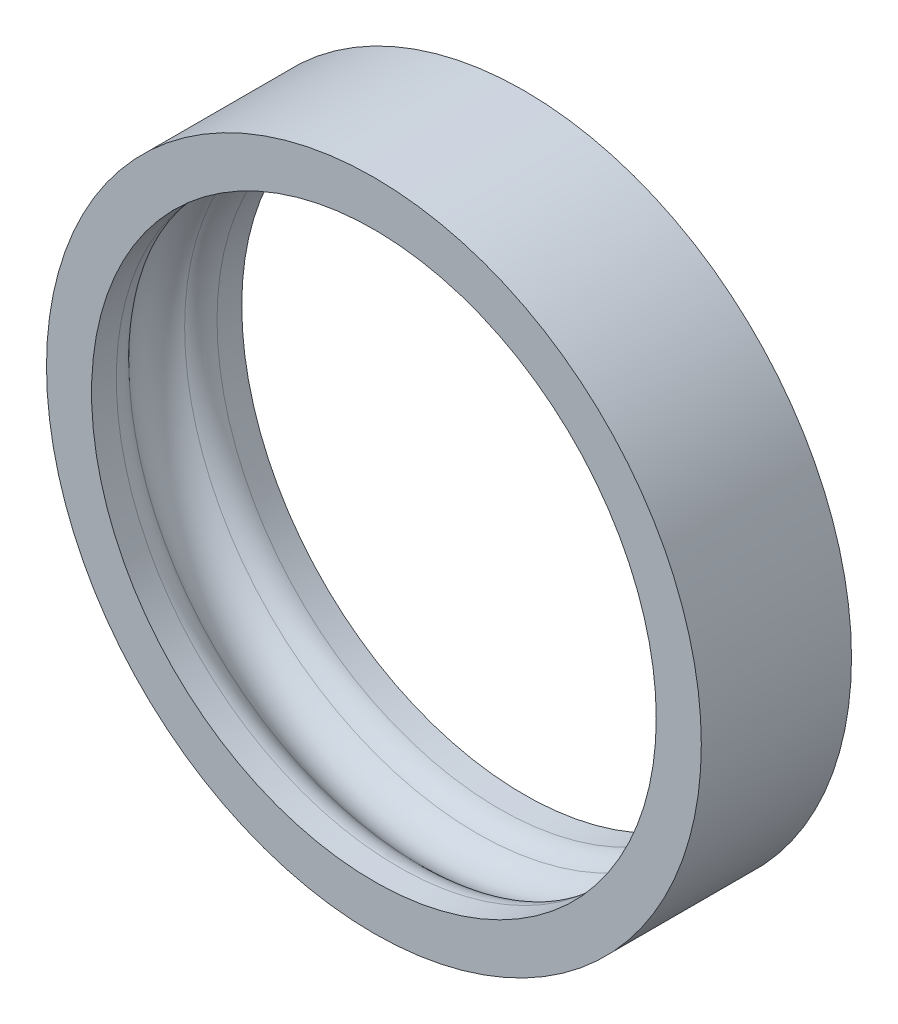
ISO-10303-21;
HEADER;
FILE_DESCRIPTION(('STEP AP214'),'2;1');
FILE_NAME('part.step','',(''),(''),'','','');
FILE_SCHEMA(('AUTOMOTIVE_DESIGN { 1 0 10303 214 1 1 1 1 }'));
ENDSEC;
DATA;
#1=APPLICATION_CONTEXT('core data for automotive mechanical design processes');
#2=APPLICATION_PROTOCOL_DEFINITION('international standard','automotive_design',2000,#1);
#3=PRODUCT_CONTEXT('',#1,'mechanical');
#4=PRODUCT('Part','Part','',(#3));
#5=PRODUCT_RELATED_PRODUCT_CATEGORY('part','',(#4));
#6=PRODUCT_DEFINITION_FORMATION('','',#4);
#7=PRODUCT_DEFINITION_CONTEXT('part definition',#1,'design');
#8=PRODUCT_DEFINITION('design','',#6,#7);
#9=PRODUCT_DEFINITION_SHAPE('','',#8);
#10=(LENGTH_UNIT() NAMED_UNIT(*) SI_UNIT(.MILLI.,.METRE.));
#11=(NAMED_UNIT(*) PLANE_ANGLE_UNIT() SI_UNIT($,.RADIAN.));
#12=(NAMED_UNIT(*) SI_UNIT($,.STERADIAN.) SOLID_ANGLE_UNIT());
#13=UNCERTAINTY_MEASURE_WITH_UNIT(LENGTH_MEASURE(1.E-05),#10,'distance_accuracy_value','');
#14=(GEOMETRIC_REPRESENTATION_CONTEXT(3) GLOBAL_UNCERTAINTY_ASSIGNED_CONTEXT((#13)) GLOBAL_UNIT_ASSIGNED_CONTEXT((#10,
#11,#12)) REPRESENTATION_CONTEXT('',''));
#15=CARTESIAN_POINT('',(0.,0.,0.));
#16=DIRECTION('',(0.,0.,1.));
#17=DIRECTION('',(1.,0.,0.));
#18=AXIS2_PLACEMENT_3D('',#15,#16,#17);
#19=CARTESIAN_POINT('',(0.,0.,2.5));
#20=DIRECTION('',(0.,0.,-1.));
#21=DIRECTION('',(-1.,0.,0.));
#22=AXIS2_PLACEMENT_3D('',#19,#20,#21);
#23=CYLINDRICAL_SURFACE('',#22,9.4);
#24=CARTESIAN_POINT('',(0.,0.,1.67705098312638));
#25=DIRECTION('',(0.,0.,1.));
#26=DIRECTION('',(1.,0.,0.));
#27=AXIS2_PLACEMENT_3D('',#24,#25,#26);
#28=CIRCLE('',#27,9.4);
#29=CARTESIAN_POINT('',(9.4,0.,1.67705098312638));
#30=VERTEX_POINT('',#29);
#31=EDGE_CURVE('E53',#30,#30,#28,.F.);
#32=ORIENTED_EDGE('',*,*,#31,.T.);
#33=EDGE_LOOP('',(#32));
#34=FACE_BOUND('',#33,.T.);
#35=CARTESIAN_POINT('',(0.,0.,2.5));
#36=DIRECTION('',(0.,0.,1.));
#37=DIRECTION('',(1.,0.,0.));
#38=AXIS2_PLACEMENT_3D('',#35,#36,#37);
#39=CIRCLE('',#38,9.4);
#40=CARTESIAN_POINT('',(9.4,0.,2.5));
#41=VERTEX_POINT('',#40);
#42=EDGE_CURVE('E62',#41,#41,#39,.T.);
#43=ORIENTED_EDGE('',*,*,#42,.T.);
#44=EDGE_LOOP('',(#43));
#45=FACE_BOUND('',#44,.T.);
#46=ADVANCED_FACE('F38',(#34,#45),#23,.F.);
#47=CARTESIAN_POINT('',(0.,0.,-1.67705098312638));
#48=DIRECTION('',(0.,0.,-1.));
#49=DIRECTION('',(-1.,0.,0.));
#50=AXIS2_PLACEMENT_3D('',#47,#48,#49);
#51=CIRCLE('',#50,9.4);
#52=CARTESIAN_POINT('',(-9.4,0.,-1.67705098312638));
#53=VERTEX_POINT('',#52);
#54=EDGE_CURVE('E10',#53,#53,#51,.F.);
#55=ORIENTED_EDGE('',*,*,#54,.T.);
#56=EDGE_LOOP('',(#55));
#57=FACE_BOUND('',#56,.T.);
#58=CARTESIAN_POINT('',(0.,0.,-2.5));
#59=DIRECTION('',(0.,0.,1.));
#60=DIRECTION('',(1.,0.,0.));
#61=AXIS2_PLACEMENT_3D('',#58,#59,#60);
#62=CIRCLE('',#61,9.4);
#63=CARTESIAN_POINT('',(9.4,0.,-2.5));
#64=VERTEX_POINT('',#63);
#65=EDGE_CURVE('E65',#64,#64,#62,.T.);
#66=ORIENTED_EDGE('',*,*,#65,.F.);
#67=EDGE_LOOP('',(#66));
#68=FACE_BOUND('',#67,.T.);
#69=ADVANCED_FACE('F75',(#57,#68),#23,.F.);
#70=CARTESIAN_POINT('',(0.,0.,2.5));
#71=DIRECTION('',(0.,0.,1.));
#72=DIRECTION('',(1.,0.,0.));
#73=AXIS2_PLACEMENT_3D('',#70,#71,#72);
#74=PLANE('',#73);
#75=CARTESIAN_POINT('',(0.,0.,2.5));
#76=DIRECTION('',(0.,0.,1.));
#77=DIRECTION('',(1.,0.,0.));
#78=AXIS2_PLACEMENT_3D('',#75,#76,#77);
#79=CIRCLE('',#78,10.9);
#80=CARTESIAN_POINT('',(10.9,0.,2.5));
#81=VERTEX_POINT('',#80);
#82=EDGE_CURVE('E58',#81,#81,#79,.T.);
#83=ORIENTED_EDGE('',*,*,#82,.T.);
#84=EDGE_LOOP('',(#83));
#85=FACE_BOUND('',#84,.T.);
#86=ORIENTED_EDGE('',*,*,#42,.F.);
#87=EDGE_LOOP('',(#86));
#88=FACE_BOUND('',#87,.T.);
#89=ADVANCED_FACE('F72',(#85,#88),#74,.T.);
#90=CARTESIAN_POINT('',(0.,0.,-2.5));
#91=DIRECTION('',(0.,0.,1.));
#92=DIRECTION('',(1.,0.,0.));
#93=AXIS2_PLACEMENT_3D('',#90,#91,#92);
#94=PLANE('',#93);
#95=CARTESIAN_POINT('',(0.,0.,-2.5));
#96=DIRECTION('',(0.,0.,1.));
#97=DIRECTION('',(1.,0.,0.));
#98=AXIS2_PLACEMENT_3D('',#95,#96,#97);
#99=CIRCLE('',#98,10.9);
#100=CARTESIAN_POINT('',(10.9,0.,-2.5));
#101=VERTEX_POINT('',#100);
#102=EDGE_CURVE('E59',#101,#101,#99,.T.);
#103=ORIENTED_EDGE('',*,*,#102,.F.);
#104=EDGE_LOOP('',(#103));
#105=FACE_BOUND('',#104,.T.);
#106=ORIENTED_EDGE('',*,*,#65,.T.);
#107=EDGE_LOOP('',(#106));
#108=FACE_BOUND('',#107,.T.);
#109=ADVANCED_FACE('F74',(#105,#108),#94,.F.);
#110=CARTESIAN_POINT('',(0.,0.,2.5));
#111=DIRECTION('',(0.,0.,-1.));
#112=DIRECTION('',(-1.,0.,0.));
#113=AXIS2_PLACEMENT_3D('',#110,#111,#112);
#114=CYLINDRICAL_SURFACE('',#113,10.9);
#115=ORIENTED_EDGE('',*,*,#82,.F.);
#116=EDGE_LOOP('',(#115));
#117=FACE_BOUND('',#116,.T.);
#118=ORIENTED_EDGE('',*,*,#102,.T.);
#119=EDGE_LOOP('',(#118));
#120=FACE_BOUND('',#119,.T.);
#121=ADVANCED_FACE('F82',(#117,#120),#114,.T.);
#122=CARTESIAN_POINT('',(0.,0.,0.));
#123=DIRECTION('',(0.,0.,1.));
#124=DIRECTION('',(1.,0.,0.));
#125=AXIS2_PLACEMENT_3D('',#122,#123,#124);
#126=TOROIDAL_SURFACE('',#125,8.9,1.25);
#127=CARTESIAN_POINT('',(0.,0.,0.931694990625439));
#128=DIRECTION('',(0.,0.,-1.));
#129=DIRECTION('',(-1.,0.,0.));
#130=AXIS2_PLACEMENT_3D('',#127,#128,#129);
#131=CIRCLE('',#130,9.73333333333274);
#132=CARTESIAN_POINT('',(-9.73333333333274,0.,0.931694990625439));
#133=VERTEX_POINT('',#132);
#134=EDGE_CURVE('E45',#133,#133,#131,.F.);
#135=ORIENTED_EDGE('',*,*,#134,.T.);
#136=EDGE_LOOP('',(#135));
#137=FACE_BOUND('',#136,.T.);
#138=CARTESIAN_POINT('',(0.,0.,-0.931694990625431));
#139=DIRECTION('',(0.,0.,1.));
#140=DIRECTION('',(1.,0.,0.));
#141=AXIS2_PLACEMENT_3D('',#138,#139,#140);
#142=CIRCLE('',#141,9.73333333333274);
#143=CARTESIAN_POINT('',(9.73333333333274,0.,-0.931694990625431));
#144=VERTEX_POINT('',#143);
#145=EDGE_CURVE('E49',#144,#144,#142,.F.);
#146=ORIENTED_EDGE('',*,*,#145,.T.);
#147=EDGE_LOOP('',(#146));
#148=FACE_BOUND('',#147,.T.);
#149=ADVANCED_FACE('F91',(#137,#148),#126,.F.);
#150=CARTESIAN_POINT('',(0.,0.,1.67705098312638));
#151=DIRECTION('',(0.,0.,1.));
#152=DIRECTION('',(1.,0.,0.));
#153=AXIS2_PLACEMENT_3D('',#150,#151,#152);
#154=TOROIDAL_SURFACE('',#153,10.3999999999995,1.);
#155=ORIENTED_EDGE('',*,*,#134,.F.);
#156=EDGE_LOOP('',(#155));
#157=FACE_BOUND('',#156,.T.);
#158=ORIENTED_EDGE('',*,*,#31,.F.);
#159=EDGE_LOOP('',(#158));
#160=FACE_BOUND('',#159,.T.);
#161=ADVANCED_FACE('F93',(#157,#160),#154,.T.);
#162=CARTESIAN_POINT('',(0.,0.,-1.67705098312638));
#163=DIRECTION('',(0.,0.,-1.));
#164=DIRECTION('',(-1.,0.,0.));
#165=AXIS2_PLACEMENT_3D('',#162,#163,#164);
#166=TOROIDAL_SURFACE('',#165,10.3999999999995,1.);
#167=ORIENTED_EDGE('',*,*,#145,.F.);
#168=EDGE_LOOP('',(#167));
#169=FACE_BOUND('',#168,.T.);
#170=ORIENTED_EDGE('',*,*,#54,.F.);
#171=EDGE_LOOP('',(#170));
#172=FACE_BOUND('',#171,.T.);
#173=ADVANCED_FACE('F40',(#169,#172),#166,.T.);
#174=CLOSED_SHELL('',(#46,#69,#89,#109,#121,#149,#161,#173));
#175=MANIFOLD_SOLID_BREP('B2',#174);
#176=ADVANCED_BREP_SHAPE_REPRESENTATION('',(#18,#175),#14);
#177=SHAPE_DEFINITION_REPRESENTATION(#9,#176);
ENDSEC;
END-ISO-10303-21;
